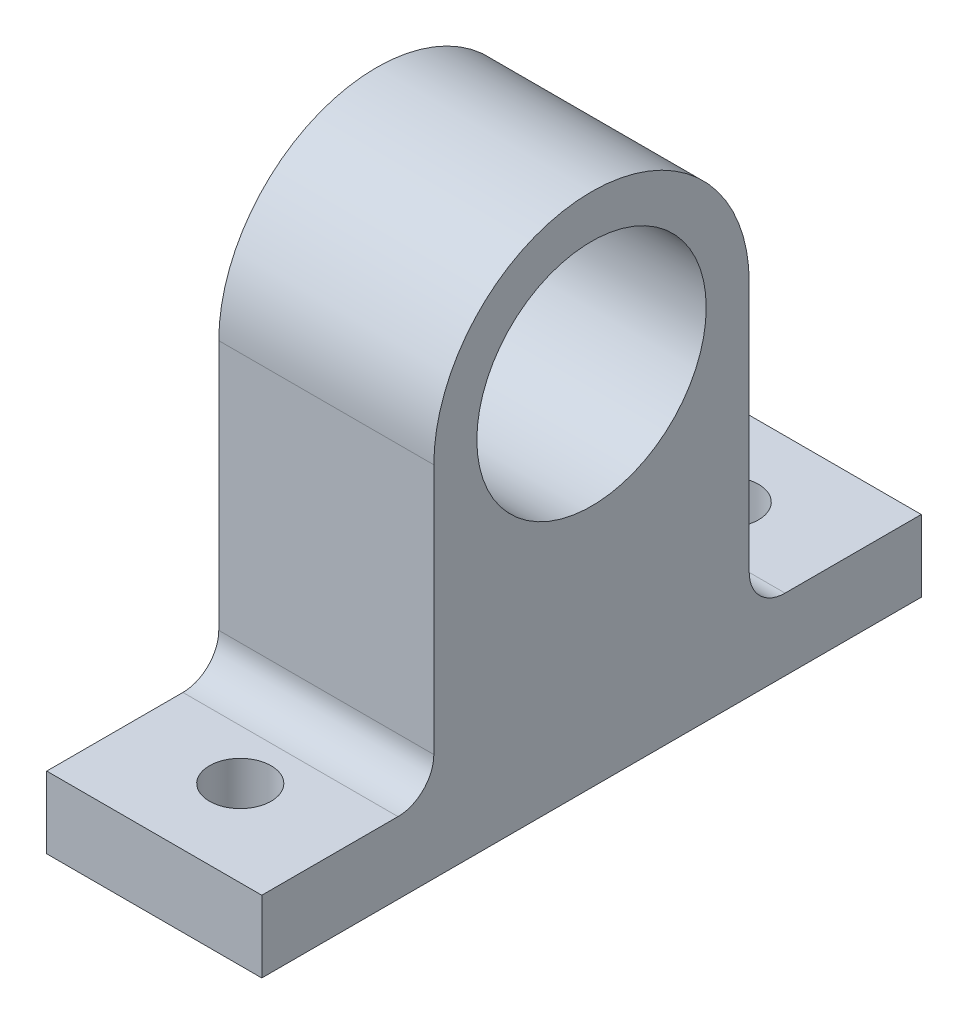
ISO-10303-21;
HEADER;
FILE_DESCRIPTION(('STEP AP214'),'2;1');
FILE_NAME('part.step','',(''),(''),'','','');
FILE_SCHEMA(('AUTOMOTIVE_DESIGN { 1 0 10303 214 1 1 1 1 }'));
ENDSEC;
DATA;
#1=APPLICATION_CONTEXT('core data for automotive mechanical design processes');
#2=APPLICATION_PROTOCOL_DEFINITION('international standard','automotive_design',2000,#1);
#3=PRODUCT_CONTEXT('',#1,'mechanical');
#4=PRODUCT('Part','Part','',(#3));
#5=PRODUCT_RELATED_PRODUCT_CATEGORY('part','',(#4));
#6=PRODUCT_DEFINITION_FORMATION('','',#4);
#7=PRODUCT_DEFINITION_CONTEXT('part definition',#1,'design');
#8=PRODUCT_DEFINITION('design','',#6,#7);
#9=PRODUCT_DEFINITION_SHAPE('','',#8);
#10=(LENGTH_UNIT() NAMED_UNIT(*) SI_UNIT(.MILLI.,.METRE.));
#11=(NAMED_UNIT(*) PLANE_ANGLE_UNIT() SI_UNIT($,.RADIAN.));
#12=(NAMED_UNIT(*) SI_UNIT($,.STERADIAN.) SOLID_ANGLE_UNIT());
#13=UNCERTAINTY_MEASURE_WITH_UNIT(LENGTH_MEASURE(1.E-05),#10,'distance_accuracy_value','');
#14=(GEOMETRIC_REPRESENTATION_CONTEXT(3) GLOBAL_UNCERTAINTY_ASSIGNED_CONTEXT((#13)) GLOBAL_UNIT_ASSIGNED_CONTEXT((#10,
#11,#12)) REPRESENTATION_CONTEXT('',''));
#15=CARTESIAN_POINT('',(0.,0.,0.));
#16=DIRECTION('',(0.,0.,1.));
#17=DIRECTION('',(1.,0.,0.));
#18=AXIS2_PLACEMENT_3D('',#15,#16,#17);
#19=CARTESIAN_POINT('',(15.,12.5,0.));
#20=DIRECTION('',(1.,0.,0.));
#21=DIRECTION('',(0.,0.,-1.));
#22=AXIS2_PLACEMENT_3D('',#19,#20,#21);
#23=PLANE('',#22);
#24=DIRECTION('',(0.,-1.,0.));
#25=VECTOR('',#24,1.);
#26=CARTESIAN_POINT('',(15.,12.5,11.));
#27=LINE('',#26,#25);
#28=CARTESIAN_POINT('',(15.,12.5,11.));
#29=VERTEX_POINT('',#28);
#30=CARTESIAN_POINT('',(15.,-5.,11.));
#31=VERTEX_POINT('',#30);
#32=EDGE_CURVE('E198',#29,#31,#27,.T.);
#33=ORIENTED_EDGE('',*,*,#32,.T.);
#34=CARTESIAN_POINT('',(15.,-5.,13.5));
#35=DIRECTION('',(1.,0.,0.));
#36=DIRECTION('',(0.,0.,-1.));
#37=AXIS2_PLACEMENT_3D('',#34,#35,#36);
#38=CIRCLE('',#37,2.5);
#39=CARTESIAN_POINT('',(15.,-7.5,13.5));
#40=VERTEX_POINT('',#39);
#41=EDGE_CURVE('E50',#31,#40,#38,.F.);
#42=ORIENTED_EDGE('',*,*,#41,.T.);
#43=DIRECTION('',(0.,0.,1.));
#44=VECTOR('',#43,1.);
#45=CARTESIAN_POINT('',(15.,-7.5,-50.8113883008419));
#46=LINE('',#45,#44);
#47=CARTESIAN_POINT('',(15.,-7.5,23.));
#48=VERTEX_POINT('',#47);
#49=EDGE_CURVE('E162',#40,#48,#46,.T.);
#50=ORIENTED_EDGE('',*,*,#49,.T.);
#51=DIRECTION('',(0.,1.,0.));
#52=VECTOR('',#51,1.);
#53=CARTESIAN_POINT('',(15.,-12.5,23.));
#54=LINE('',#53,#52);
#55=CARTESIAN_POINT('',(15.,-12.5,23.));
#56=VERTEX_POINT('',#55);
#57=EDGE_CURVE('E141',#56,#48,#54,.T.);
#58=ORIENTED_EDGE('',*,*,#57,.F.);
#59=DIRECTION('',(0.,0.,-1.));
#60=VECTOR('',#59,1.);
#61=CARTESIAN_POINT('',(15.,-12.5,11.));
#62=LINE('',#61,#60);
#63=CARTESIAN_POINT('',(15.,-12.5,-23.));
#64=VERTEX_POINT('',#63);
#65=EDGE_CURVE('E136',#56,#64,#62,.T.);
#66=ORIENTED_EDGE('',*,*,#65,.T.);
#67=DIRECTION('',(0.,-1.,0.));
#68=VECTOR('',#67,1.);
#69=CARTESIAN_POINT('',(15.,-12.5,-23.));
#70=LINE('',#69,#68);
#71=CARTESIAN_POINT('',(15.,-7.5,-23.));
#72=VERTEX_POINT('',#71);
#73=EDGE_CURVE('E163',#72,#64,#70,.T.);
#74=ORIENTED_EDGE('',*,*,#73,.F.);
#75=CARTESIAN_POINT('',(15.,-7.5,-13.5));
#76=VERTEX_POINT('',#75);
#77=EDGE_CURVE('E178',#72,#76,#46,.T.);
#78=ORIENTED_EDGE('',*,*,#77,.T.);
#79=CARTESIAN_POINT('',(15.,-5.,-13.5));
#80=DIRECTION('',(1.,0.,0.));
#81=DIRECTION('',(0.,0.,-1.));
#82=AXIS2_PLACEMENT_3D('',#79,#80,#81);
#83=CIRCLE('',#82,2.5);
#84=CARTESIAN_POINT('',(15.,-5.,-11.));
#85=VERTEX_POINT('',#84);
#86=EDGE_CURVE('E235',#76,#85,#83,.F.);
#87=ORIENTED_EDGE('',*,*,#86,.T.);
#88=DIRECTION('',(0.,1.,0.));
#89=VECTOR('',#88,1.);
#90=CARTESIAN_POINT('',(15.,12.5,-11.));
#91=LINE('',#90,#89);
#92=CARTESIAN_POINT('',(15.,12.5,-11.));
#93=VERTEX_POINT('',#92);
#94=EDGE_CURVE('E130',#85,#93,#91,.T.);
#95=ORIENTED_EDGE('',*,*,#94,.T.);
#96=CARTESIAN_POINT('',(15.,12.5,0.));
#97=DIRECTION('',(1.,0.,0.));
#98=DIRECTION('',(0.,0.,-1.));
#99=AXIS2_PLACEMENT_3D('',#96,#97,#98);
#100=CIRCLE('',#99,11.);
#101=EDGE_CURVE('E195',#93,#29,#100,.T.);
#102=ORIENTED_EDGE('',*,*,#101,.T.);
#103=EDGE_LOOP('',(#33,#42,#50,#58,#66,#74,#78,#87,#95,#102));
#104=FACE_BOUND('',#103,.T.);
#105=CARTESIAN_POINT('',(15.,12.5,0.));
#106=DIRECTION('',(1.,0.,0.));
#107=DIRECTION('',(0.,0.,-1.));
#108=AXIS2_PLACEMENT_3D('',#105,#106,#107);
#109=CIRCLE('',#108,8.);
#110=CARTESIAN_POINT('',(15.,12.5,-8.));
#111=VERTEX_POINT('',#110);
#112=EDGE_CURVE('E185',#111,#111,#109,.T.);
#113=ORIENTED_EDGE('',*,*,#112,.F.);
#114=EDGE_LOOP('',(#113));
#115=FACE_BOUND('',#114,.T.);
#116=ADVANCED_FACE('F41',(#104,#115),#23,.T.);
#117=CARTESIAN_POINT('',(0.,12.5,0.));
#118=DIRECTION('',(1.,0.,0.));
#119=DIRECTION('',(0.,0.,-1.));
#120=AXIS2_PLACEMENT_3D('',#117,#118,#119);
#121=PLANE('',#120);
#122=DIRECTION('',(0.,1.,0.));
#123=VECTOR('',#122,1.);
#124=CARTESIAN_POINT('',(0.,12.5,-11.));
#125=LINE('',#124,#123);
#126=CARTESIAN_POINT('',(0.,-5.,-11.));
#127=VERTEX_POINT('',#126);
#128=CARTESIAN_POINT('',(0.,12.5,-11.));
#129=VERTEX_POINT('',#128);
#130=EDGE_CURVE('E189',#127,#129,#125,.T.);
#131=ORIENTED_EDGE('',*,*,#130,.F.);
#132=CARTESIAN_POINT('',(0.,-5.,-13.5));
#133=DIRECTION('',(1.,0.,0.));
#134=DIRECTION('',(0.,0.,-1.));
#135=AXIS2_PLACEMENT_3D('',#132,#133,#134);
#136=CIRCLE('',#135,2.5);
#137=CARTESIAN_POINT('',(0.,-7.5,-13.5));
#138=VERTEX_POINT('',#137);
#139=EDGE_CURVE('E232',#127,#138,#136,.T.);
#140=ORIENTED_EDGE('',*,*,#139,.T.);
#141=DIRECTION('',(0.,0.,1.));
#142=VECTOR('',#141,1.);
#143=CARTESIAN_POINT('',(0.,-7.5,-50.8113883008419));
#144=LINE('',#143,#142);
#145=CARTESIAN_POINT('',(0.,-7.5,-23.));
#146=VERTEX_POINT('',#145);
#147=EDGE_CURVE('E168',#146,#138,#144,.T.);
#148=ORIENTED_EDGE('',*,*,#147,.F.);
#149=DIRECTION('',(0.,1.,0.));
#150=VECTOR('',#149,1.);
#151=CARTESIAN_POINT('',(0.,-12.5,-23.));
#152=LINE('',#151,#150);
#153=CARTESIAN_POINT('',(0.,-12.5,-23.));
#154=VERTEX_POINT('',#153);
#155=EDGE_CURVE('E125',#154,#146,#152,.T.);
#156=ORIENTED_EDGE('',*,*,#155,.F.);
#157=DIRECTION('',(0.,0.,-1.));
#158=VECTOR('',#157,1.);
#159=CARTESIAN_POINT('',(0.,-12.5,11.));
#160=LINE('',#159,#158);
#161=CARTESIAN_POINT('',(0.,-12.5,23.));
#162=VERTEX_POINT('',#161);
#163=EDGE_CURVE('E117',#162,#154,#160,.T.);
#164=ORIENTED_EDGE('',*,*,#163,.F.);
#165=DIRECTION('',(0.,-1.,0.));
#166=VECTOR('',#165,1.);
#167=CARTESIAN_POINT('',(0.,-12.5,23.));
#168=LINE('',#167,#166);
#169=CARTESIAN_POINT('',(0.,-7.5,23.));
#170=VERTEX_POINT('',#169);
#171=EDGE_CURVE('E123',#170,#162,#168,.T.);
#172=ORIENTED_EDGE('',*,*,#171,.F.);
#173=CARTESIAN_POINT('',(0.,-7.5,13.5));
#174=VERTEX_POINT('',#173);
#175=EDGE_CURVE('E177',#174,#170,#144,.T.);
#176=ORIENTED_EDGE('',*,*,#175,.F.);
#177=CARTESIAN_POINT('',(0.,-5.,13.5));
#178=DIRECTION('',(1.,0.,0.));
#179=DIRECTION('',(0.,0.,-1.));
#180=AXIS2_PLACEMENT_3D('',#177,#178,#179);
#181=CIRCLE('',#180,2.5);
#182=CARTESIAN_POINT('',(0.,-5.,11.));
#183=VERTEX_POINT('',#182);
#184=EDGE_CURVE('E12',#174,#183,#181,.T.);
#185=ORIENTED_EDGE('',*,*,#184,.T.);
#186=DIRECTION('',(0.,-1.,0.));
#187=VECTOR('',#186,1.);
#188=CARTESIAN_POINT('',(0.,12.5,11.));
#189=LINE('',#188,#187);
#190=CARTESIAN_POINT('',(0.,12.5,11.));
#191=VERTEX_POINT('',#190);
#192=EDGE_CURVE('E131',#191,#183,#189,.T.);
#193=ORIENTED_EDGE('',*,*,#192,.F.);
#194=CARTESIAN_POINT('',(0.,12.5,0.));
#195=DIRECTION('',(1.,0.,0.));
#196=DIRECTION('',(0.,0.,-1.));
#197=AXIS2_PLACEMENT_3D('',#194,#195,#196);
#198=CIRCLE('',#197,11.);
#199=EDGE_CURVE('E206',#129,#191,#198,.T.);
#200=ORIENTED_EDGE('',*,*,#199,.F.);
#201=EDGE_LOOP('',(#131,#140,#148,#156,#164,#172,#176,#185,#193,#200));
#202=FACE_BOUND('',#201,.T.);
#203=CARTESIAN_POINT('',(0.,12.5,0.));
#204=DIRECTION('',(1.,0.,0.));
#205=DIRECTION('',(0.,0.,-1.));
#206=AXIS2_PLACEMENT_3D('',#203,#204,#205);
#207=CIRCLE('',#206,8.);
#208=CARTESIAN_POINT('',(0.,12.5,-8.));
#209=VERTEX_POINT('',#208);
#210=EDGE_CURVE('E184',#209,#209,#207,.T.);
#211=ORIENTED_EDGE('',*,*,#210,.T.);
#212=EDGE_LOOP('',(#211));
#213=FACE_BOUND('',#212,.T.);
#214=ADVANCED_FACE('F120',(#202,#213),#121,.F.);
#215=CARTESIAN_POINT('',(15.,12.5,-11.));
#216=DIRECTION('',(0.,0.,1.));
#217=DIRECTION('',(0.,-1.,0.));
#218=AXIS2_PLACEMENT_3D('',#215,#216,#217);
#219=PLANE('',#218);
#220=ORIENTED_EDGE('',*,*,#94,.F.);
#221=DIRECTION('',(-1.,0.,0.));
#222=VECTOR('',#221,1.);
#223=CARTESIAN_POINT('',(15.,-5.,-11.));
#224=LINE('',#223,#222);
#225=EDGE_CURVE('E219',#85,#127,#224,.T.);
#226=ORIENTED_EDGE('',*,*,#225,.T.);
#227=ORIENTED_EDGE('',*,*,#130,.T.);
#228=DIRECTION('',(-1.,0.,0.));
#229=VECTOR('',#228,1.);
#230=CARTESIAN_POINT('',(15.,12.5,-11.));
#231=LINE('',#230,#229);
#232=EDGE_CURVE('E215',#93,#129,#231,.T.);
#233=ORIENTED_EDGE('',*,*,#232,.F.);
#234=EDGE_LOOP('',(#220,#226,#227,#233));
#235=FACE_BOUND('',#234,.T.);
#236=ADVANCED_FACE('F257',(#235),#219,.F.);
#237=CARTESIAN_POINT('',(15.,12.5,0.));
#238=DIRECTION('',(-1.,0.,0.));
#239=DIRECTION('',(0.,0.,1.));
#240=AXIS2_PLACEMENT_3D('',#237,#238,#239);
#241=CYLINDRICAL_SURFACE('',#240,11.);
#242=ORIENTED_EDGE('',*,*,#199,.T.);
#243=DIRECTION('',(-1.,0.,0.));
#244=VECTOR('',#243,1.);
#245=CARTESIAN_POINT('',(15.,12.5,11.));
#246=LINE('',#245,#244);
#247=EDGE_CURVE('E203',#29,#191,#246,.T.);
#248=ORIENTED_EDGE('',*,*,#247,.F.);
#249=ORIENTED_EDGE('',*,*,#101,.F.);
#250=ORIENTED_EDGE('',*,*,#232,.T.);
#251=EDGE_LOOP('',(#242,#248,#249,#250));
#252=FACE_BOUND('',#251,.T.);
#253=ADVANCED_FACE('F254',(#252),#241,.T.);
#254=CARTESIAN_POINT('',(15.,12.5,11.));
#255=DIRECTION('',(0.,0.,-1.));
#256=DIRECTION('',(0.,1.,0.));
#257=AXIS2_PLACEMENT_3D('',#254,#255,#256);
#258=PLANE('',#257);
#259=ORIENTED_EDGE('',*,*,#192,.T.);
#260=DIRECTION('',(1.,0.,0.));
#261=VECTOR('',#260,1.);
#262=CARTESIAN_POINT('',(15.,-5.,11.));
#263=LINE('',#262,#261);
#264=EDGE_CURVE('E226',#183,#31,#263,.T.);
#265=ORIENTED_EDGE('',*,*,#264,.T.);
#266=ORIENTED_EDGE('',*,*,#32,.F.);
#267=ORIENTED_EDGE('',*,*,#247,.T.);
#268=EDGE_LOOP('',(#259,#265,#266,#267));
#269=FACE_BOUND('',#268,.T.);
#270=ADVANCED_FACE('F248',(#269),#258,.F.);
#271=CARTESIAN_POINT('',(15.,-12.5,11.));
#272=DIRECTION('',(0.,1.,0.));
#273=DIRECTION('',(0.,0.,1.));
#274=AXIS2_PLACEMENT_3D('',#271,#272,#273);
#275=PLANE('',#274);
#276=CARTESIAN_POINT('',(7.5,-12.5,17.));
#277=DIRECTION('',(0.,1.,0.));
#278=DIRECTION('',(0.,0.,1.));
#279=AXIS2_PLACEMENT_3D('',#276,#277,#278);
#280=CIRCLE('',#279,2.15);
#281=CARTESIAN_POINT('',(7.5,-12.5,19.15));
#282=VERTEX_POINT('',#281);
#283=EDGE_CURVE('E148',#282,#282,#280,.F.);
#284=ORIENTED_EDGE('',*,*,#283,.F.);
#285=EDGE_LOOP('',(#284));
#286=FACE_BOUND('',#285,.T.);
#287=CARTESIAN_POINT('',(7.5,-12.5,-17.));
#288=DIRECTION('',(0.,1.,0.));
#289=DIRECTION('',(0.,0.,1.));
#290=AXIS2_PLACEMENT_3D('',#287,#288,#289);
#291=CIRCLE('',#290,2.15);
#292=CARTESIAN_POINT('',(7.5,-12.5,-14.85));
#293=VERTEX_POINT('',#292);
#294=EDGE_CURVE('E155',#293,#293,#291,.F.);
#295=ORIENTED_EDGE('',*,*,#294,.F.);
#296=EDGE_LOOP('',(#295));
#297=FACE_BOUND('',#296,.T.);
#298=ORIENTED_EDGE('',*,*,#163,.T.);
#299=DIRECTION('',(-1.,0.,0.));
#300=VECTOR('',#299,1.);
#301=CARTESIAN_POINT('',(0.,-12.5,-23.));
#302=LINE('',#301,#300);
#303=EDGE_CURVE('E173',#64,#154,#302,.T.);
#304=ORIENTED_EDGE('',*,*,#303,.F.);
#305=ORIENTED_EDGE('',*,*,#65,.F.);
#306=DIRECTION('',(1.,0.,0.));
#307=VECTOR('',#306,1.);
#308=CARTESIAN_POINT('',(0.,-12.5,23.));
#309=LINE('',#308,#307);
#310=EDGE_CURVE('E134',#162,#56,#309,.T.);
#311=ORIENTED_EDGE('',*,*,#310,.F.);
#312=EDGE_LOOP('',(#298,#304,#305,#311));
#313=FACE_BOUND('',#312,.T.);
#314=ADVANCED_FACE('F135',(#286,#297,#313),#275,.F.);
#315=CARTESIAN_POINT('',(15.,12.5,0.));
#316=DIRECTION('',(-1.,0.,0.));
#317=DIRECTION('',(0.,0.,1.));
#318=AXIS2_PLACEMENT_3D('',#315,#316,#317);
#319=CYLINDRICAL_SURFACE('',#318,8.);
#320=ORIENTED_EDGE('',*,*,#112,.T.);
#321=EDGE_LOOP('',(#320));
#322=FACE_BOUND('',#321,.T.);
#323=ORIENTED_EDGE('',*,*,#210,.F.);
#324=EDGE_LOOP('',(#323));
#325=FACE_BOUND('',#324,.T.);
#326=ADVANCED_FACE('F290',(#322,#325),#319,.F.);
#327=CARTESIAN_POINT('',(0.,0.,23.));
#328=DIRECTION('',(0.,0.,-1.));
#329=DIRECTION('',(-1.,0.,0.));
#330=AXIS2_PLACEMENT_3D('',#327,#328,#329);
#331=PLANE('',#330);
#332=ORIENTED_EDGE('',*,*,#171,.T.);
#333=ORIENTED_EDGE('',*,*,#310,.T.);
#334=ORIENTED_EDGE('',*,*,#57,.T.);
#335=DIRECTION('',(-1.,0.,0.));
#336=VECTOR('',#335,1.);
#337=CARTESIAN_POINT('',(0.,-7.5,23.));
#338=LINE('',#337,#336);
#339=EDGE_CURVE('E146',#48,#170,#338,.T.);
#340=ORIENTED_EDGE('',*,*,#339,.T.);
#341=EDGE_LOOP('',(#332,#333,#334,#340));
#342=FACE_BOUND('',#341,.T.);
#343=ADVANCED_FACE('F144',(#342),#331,.F.);
#344=CARTESIAN_POINT('',(0.,-7.5,-50.8113883008419));
#345=DIRECTION('',(0.,1.,0.));
#346=DIRECTION('',(-1.,0.,0.));
#347=AXIS2_PLACEMENT_3D('',#344,#345,#346);
#348=PLANE('',#347);
#349=CARTESIAN_POINT('',(7.5,-7.5,17.));
#350=DIRECTION('',(0.,1.,0.));
#351=DIRECTION('',(-1.,0.,0.));
#352=AXIS2_PLACEMENT_3D('',#349,#350,#351);
#353=CIRCLE('',#352,2.15);
#354=CARTESIAN_POINT('',(5.35,-7.5,17.));
#355=VERTEX_POINT('',#354);
#356=EDGE_CURVE('E152',#355,#355,#353,.T.);
#357=ORIENTED_EDGE('',*,*,#356,.F.);
#358=EDGE_LOOP('',(#357));
#359=FACE_BOUND('',#358,.T.);
#360=ORIENTED_EDGE('',*,*,#49,.F.);
#361=DIRECTION('',(1.,0.,0.));
#362=VECTOR('',#361,1.);
#363=CARTESIAN_POINT('',(0.,-7.5,13.5));
#364=LINE('',#363,#362);
#365=EDGE_CURVE('E63',#40,#174,#364,.F.);
#366=ORIENTED_EDGE('',*,*,#365,.T.);
#367=ORIENTED_EDGE('',*,*,#175,.T.);
#368=ORIENTED_EDGE('',*,*,#339,.F.);
#369=EDGE_LOOP('',(#360,#366,#367,#368));
#370=FACE_BOUND('',#369,.T.);
#371=ADVANCED_FACE('F241',(#359,#370),#348,.T.);
#372=CARTESIAN_POINT('',(7.5,-7.5,-17.));
#373=DIRECTION('',(0.,1.,0.));
#374=DIRECTION('',(1.,0.,0.));
#375=AXIS2_PLACEMENT_3D('',#372,#373,#374);
#376=CIRCLE('',#375,2.15);
#377=CARTESIAN_POINT('',(9.65,-7.5,-17.));
#378=VERTEX_POINT('',#377);
#379=EDGE_CURVE('E415',#378,#378,#376,.T.);
#380=ORIENTED_EDGE('',*,*,#379,.F.);
#381=EDGE_LOOP('',(#380));
#382=FACE_BOUND('',#381,.T.);
#383=ORIENTED_EDGE('',*,*,#147,.T.);
#384=DIRECTION('',(-1.,0.,0.));
#385=VECTOR('',#384,1.);
#386=CARTESIAN_POINT('',(0.,-7.5,-13.5));
#387=LINE('',#386,#385);
#388=EDGE_CURVE('E223',#138,#76,#387,.F.);
#389=ORIENTED_EDGE('',*,*,#388,.T.);
#390=ORIENTED_EDGE('',*,*,#77,.F.);
#391=DIRECTION('',(1.,0.,0.));
#392=VECTOR('',#391,1.);
#393=CARTESIAN_POINT('',(0.,-7.5,-23.));
#394=LINE('',#393,#392);
#395=EDGE_CURVE('E167',#146,#72,#394,.T.);
#396=ORIENTED_EDGE('',*,*,#395,.F.);
#397=EDGE_LOOP('',(#383,#389,#390,#396));
#398=FACE_BOUND('',#397,.T.);
#399=ADVANCED_FACE('F265',(#382,#398),#348,.T.);
#400=CARTESIAN_POINT('',(15.,12.5,-23.));
#401=DIRECTION('',(0.,0.,1.));
#402=DIRECTION('',(0.,-1.,0.));
#403=AXIS2_PLACEMENT_3D('',#400,#401,#402);
#404=PLANE('',#403);
#405=ORIENTED_EDGE('',*,*,#155,.T.);
#406=ORIENTED_EDGE('',*,*,#395,.T.);
#407=ORIENTED_EDGE('',*,*,#73,.T.);
#408=ORIENTED_EDGE('',*,*,#303,.T.);
#409=EDGE_LOOP('',(#405,#406,#407,#408));
#410=FACE_BOUND('',#409,.T.);
#411=ADVANCED_FACE('F269',(#410),#404,.F.);
#412=CARTESIAN_POINT('',(7.5,-18.5811183182043,-17.));
#413=DIRECTION('',(0.,1.,0.));
#414=DIRECTION('',(-1.,0.,0.));
#415=AXIS2_PLACEMENT_3D('',#412,#413,#414);
#416=CYLINDRICAL_SURFACE('',#415,2.15);
#417=ORIENTED_EDGE('',*,*,#294,.T.);
#418=EDGE_LOOP('',(#417));
#419=FACE_BOUND('',#418,.T.);
#420=ORIENTED_EDGE('',*,*,#379,.T.);
#421=EDGE_LOOP('',(#420));
#422=FACE_BOUND('',#421,.T.);
#423=ADVANCED_FACE('F271',(#419,#422),#416,.F.);
#424=CARTESIAN_POINT('',(7.5,-18.5811183182043,17.));
#425=DIRECTION('',(0.,1.,0.));
#426=DIRECTION('',(-1.,0.,0.));
#427=AXIS2_PLACEMENT_3D('',#424,#425,#426);
#428=CYLINDRICAL_SURFACE('',#427,2.15);
#429=ORIENTED_EDGE('',*,*,#283,.T.);
#430=EDGE_LOOP('',(#429));
#431=FACE_BOUND('',#430,.T.);
#432=ORIENTED_EDGE('',*,*,#356,.T.);
#433=EDGE_LOOP('',(#432));
#434=FACE_BOUND('',#433,.T.);
#435=ADVANCED_FACE('F277',(#431,#434),#428,.F.);
#436=CARTESIAN_POINT('',(15.,-5.,-13.5));
#437=DIRECTION('',(-1.,0.,0.));
#438=DIRECTION('',(0.,-1.,0.));
#439=AXIS2_PLACEMENT_3D('',#436,#437,#438);
#440=CYLINDRICAL_SURFACE('',#439,2.5);
#441=ORIENTED_EDGE('',*,*,#86,.F.);
#442=ORIENTED_EDGE('',*,*,#388,.F.);
#443=ORIENTED_EDGE('',*,*,#139,.F.);
#444=ORIENTED_EDGE('',*,*,#225,.F.);
#445=EDGE_LOOP('',(#441,#442,#443,#444));
#446=FACE_BOUND('',#445,.T.);
#447=ADVANCED_FACE('F261',(#446),#440,.F.);
#448=CARTESIAN_POINT('',(15.,-5.,13.5));
#449=DIRECTION('',(1.,0.,0.));
#450=DIRECTION('',(0.,1.,0.));
#451=AXIS2_PLACEMENT_3D('',#448,#449,#450);
#452=CYLINDRICAL_SURFACE('',#451,2.5);
#453=ORIENTED_EDGE('',*,*,#184,.F.);
#454=ORIENTED_EDGE('',*,*,#365,.F.);
#455=ORIENTED_EDGE('',*,*,#41,.F.);
#456=ORIENTED_EDGE('',*,*,#264,.F.);
#457=EDGE_LOOP('',(#453,#454,#455,#456));
#458=FACE_BOUND('',#457,.T.);
#459=ADVANCED_FACE('F43',(#458),#452,.F.);
#460=CLOSED_SHELL('',(#116,#214,#236,#253,#270,#314,#326,#343,#371,#399,#411,#423,#435,#447,#459));
#461=MANIFOLD_SOLID_BREP('B2',#460);
#462=ADVANCED_BREP_SHAPE_REPRESENTATION('',(#18,#461),#14);
#463=SHAPE_DEFINITION_REPRESENTATION(#9,#462);
ENDSEC;
END-ISO-10303-21;
